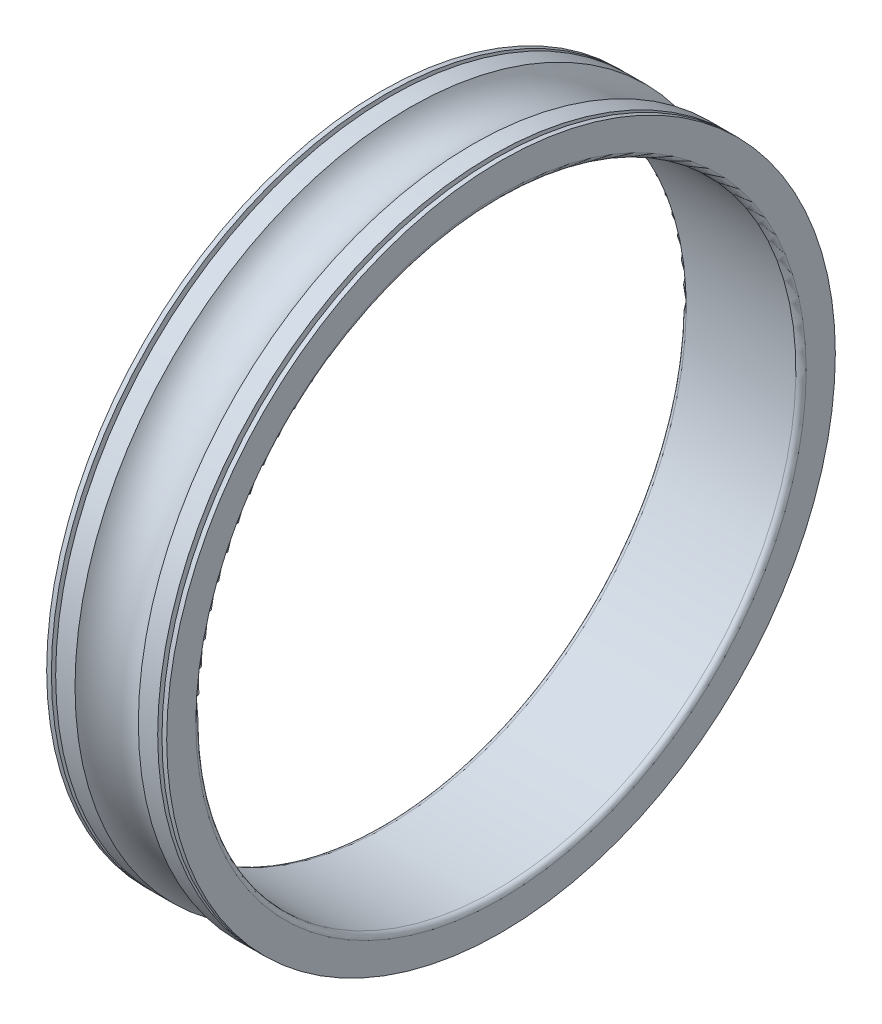
ISO-10303-21;
HEADER;
FILE_DESCRIPTION(('STEP AP214'),'2;1');
FILE_NAME('part.step','',(''),(''),'','','');
FILE_SCHEMA(('AUTOMOTIVE_DESIGN { 1 0 10303 214 1 1 1 1 }'));
ENDSEC;
DATA;
#1=APPLICATION_CONTEXT('core data for automotive mechanical design processes');
#2=APPLICATION_PROTOCOL_DEFINITION('international standard','automotive_design',2000,#1);
#3=PRODUCT_CONTEXT('',#1,'mechanical');
#4=PRODUCT('Part','Part','',(#3));
#5=PRODUCT_RELATED_PRODUCT_CATEGORY('part','',(#4));
#6=PRODUCT_DEFINITION_FORMATION('','',#4);
#7=PRODUCT_DEFINITION_CONTEXT('part definition',#1,'design');
#8=PRODUCT_DEFINITION('design','',#6,#7);
#9=PRODUCT_DEFINITION_SHAPE('','',#8);
#10=(LENGTH_UNIT() NAMED_UNIT(*) SI_UNIT(.MILLI.,.METRE.));
#11=(NAMED_UNIT(*) PLANE_ANGLE_UNIT() SI_UNIT($,.RADIAN.));
#12=(NAMED_UNIT(*) SI_UNIT($,.STERADIAN.) SOLID_ANGLE_UNIT());
#13=UNCERTAINTY_MEASURE_WITH_UNIT(LENGTH_MEASURE(1.E-05),#10,'distance_accuracy_value','');
#14=(GEOMETRIC_REPRESENTATION_CONTEXT(3) GLOBAL_UNCERTAINTY_ASSIGNED_CONTEXT((#13)) GLOBAL_UNIT_ASSIGNED_CONTEXT((#10,
#11,#12)) REPRESENTATION_CONTEXT('',''));
#15=CARTESIAN_POINT('',(0.,0.,0.));
#16=DIRECTION('',(0.,0.,1.));
#17=DIRECTION('',(1.,0.,0.));
#18=AXIS2_PLACEMENT_3D('',#15,#16,#17);
#19=CARTESIAN_POINT('',(0.,0.,0.));
#20=DIRECTION('',(-1.,0.,0.));
#21=DIRECTION('',(0.,1.,0.));
#22=AXIS2_PLACEMENT_3D('',#19,#20,#21);
#23=CYLINDRICAL_SURFACE('',#22,17.5);
#24=CARTESIAN_POINT('',(3.2,0.,0.));
#25=DIRECTION('',(1.,0.,0.));
#26=DIRECTION('',(0.,1.,0.));
#27=AXIS2_PLACEMENT_3D('',#24,#25,#26);
#28=CIRCLE('',#27,17.5);
#29=CARTESIAN_POINT('',(3.2,17.5,0.));
#30=VERTEX_POINT('',#29);
#31=EDGE_CURVE('E11',#30,#30,#28,.T.);
#32=ORIENTED_EDGE('',*,*,#31,.T.);
#33=EDGE_LOOP('',(#32));
#34=FACE_BOUND('',#33,.T.);
#35=CARTESIAN_POINT('',(-3.2,0.,0.));
#36=DIRECTION('',(1.,0.,0.));
#37=DIRECTION('',(0.,1.,0.));
#38=AXIS2_PLACEMENT_3D('',#35,#36,#37);
#39=CIRCLE('',#38,17.5);
#40=CARTESIAN_POINT('',(-3.2,17.5,0.));
#41=VERTEX_POINT('',#40);
#42=EDGE_CURVE('E90',#41,#41,#39,.T.);
#43=ORIENTED_EDGE('',*,*,#42,.F.);
#44=EDGE_LOOP('',(#43));
#45=FACE_BOUND('',#44,.T.);
#46=ADVANCED_FACE('F16',(#34,#45),#23,.F.);
#47=CARTESIAN_POINT('',(3.2,0.,0.));
#48=DIRECTION('',(1.,0.,0.));
#49=DIRECTION('',(0.,0.,-1.));
#50=AXIS2_PLACEMENT_3D('',#47,#48,#49);
#51=TOROIDAL_SURFACE('',#50,17.8,0.3);
#52=CARTESIAN_POINT('',(3.5,0.,0.));
#53=DIRECTION('',(1.,0.,0.));
#54=DIRECTION('',(0.,1.,0.));
#55=AXIS2_PLACEMENT_3D('',#52,#53,#54);
#56=CIRCLE('',#55,17.8);
#57=CARTESIAN_POINT('',(3.5,17.8,0.));
#58=VERTEX_POINT('',#57);
#59=EDGE_CURVE('E25',#58,#58,#56,.T.);
#60=ORIENTED_EDGE('',*,*,#59,.T.);
#61=EDGE_LOOP('',(#60));
#62=FACE_BOUND('',#61,.T.);
#63=ORIENTED_EDGE('',*,*,#31,.F.);
#64=EDGE_LOOP('',(#63));
#65=FACE_BOUND('',#64,.T.);
#66=ADVANCED_FACE('F140',(#62,#65),#51,.T.);
#67=CARTESIAN_POINT('',(3.5,18.65,0.));
#68=DIRECTION('',(1.,0.,0.));
#69=DIRECTION('',(0.,1.,0.));
#70=AXIS2_PLACEMENT_3D('',#67,#68,#69);
#71=PLANE('',#70);
#72=CARTESIAN_POINT('',(3.5,0.,0.));
#73=DIRECTION('',(1.,0.,0.));
#74=DIRECTION('',(0.,1.,0.));
#75=AXIS2_PLACEMENT_3D('',#72,#73,#74);
#76=CIRCLE('',#75,19.5);
#77=CARTESIAN_POINT('',(3.5,19.5,0.));
#78=VERTEX_POINT('',#77);
#79=EDGE_CURVE('E89',#78,#78,#76,.T.);
#80=ORIENTED_EDGE('',*,*,#79,.T.);
#81=EDGE_LOOP('',(#80));
#82=FACE_BOUND('',#81,.T.);
#83=ORIENTED_EDGE('',*,*,#59,.F.);
#84=EDGE_LOOP('',(#83));
#85=FACE_BOUND('',#84,.T.);
#86=ADVANCED_FACE('F145',(#82,#85),#71,.T.);
#87=CARTESIAN_POINT('',(2.67330926563097,0.,0.));
#88=DIRECTION('',(-1.,0.,0.));
#89=DIRECTION('',(0.,1.,0.));
#90=AXIS2_PLACEMENT_3D('',#87,#88,#89);
#91=CYLINDRICAL_SURFACE('',#90,19.5);
#92=ORIENTED_EDGE('',*,*,#79,.F.);
#93=EDGE_LOOP('',(#92));
#94=FACE_BOUND('',#93,.T.);
#95=CARTESIAN_POINT('',(3.225,0.,0.));
#96=DIRECTION('',(1.,0.,0.));
#97=DIRECTION('',(0.,1.,0.));
#98=AXIS2_PLACEMENT_3D('',#95,#96,#97);
#99=CIRCLE('',#98,19.5);
#100=CARTESIAN_POINT('',(3.225,-19.5,0.));
#101=VERTEX_POINT('',#100);
#102=EDGE_CURVE('E75',#101,#101,#99,.T.);
#103=ORIENTED_EDGE('',*,*,#102,.T.);
#104=EDGE_LOOP('',(#103));
#105=FACE_BOUND('',#104,.T.);
#106=ADVANCED_FACE('F76',(#94,#105),#91,.T.);
#107=CARTESIAN_POINT('',(0.,0.,0.));
#108=DIRECTION('',(1.,0.,0.));
#109=DIRECTION('',(0.,0.,-1.));
#110=AXIS2_PLACEMENT_3D('',#107,#108,#109);
#111=TOROIDAL_SURFACE('',#110,20.5,2.1);
#112=CARTESIAN_POINT('',(-1.84661853126194,0.,0.));
#113=DIRECTION('',(1.,0.,0.));
#114=DIRECTION('',(0.,1.,0.));
#115=AXIS2_PLACEMENT_3D('',#112,#113,#114);
#116=CIRCLE('',#115,19.5);
#117=CARTESIAN_POINT('',(-1.84661853126194,19.5,0.));
#118=VERTEX_POINT('',#117);
#119=EDGE_CURVE('E96',#118,#118,#116,.T.);
#120=ORIENTED_EDGE('',*,*,#119,.T.);
#121=EDGE_LOOP('',(#120));
#122=FACE_BOUND('',#121,.T.);
#123=CARTESIAN_POINT('',(1.84661853126194,0.,0.));
#124=DIRECTION('',(1.,0.,0.));
#125=DIRECTION('',(0.,1.,0.));
#126=AXIS2_PLACEMENT_3D('',#123,#124,#125);
#127=CIRCLE('',#126,19.5);
#128=CARTESIAN_POINT('',(1.84661853126194,19.5,0.));
#129=VERTEX_POINT('',#128);
#130=EDGE_CURVE('E80',#129,#129,#127,.T.);
#131=ORIENTED_EDGE('',*,*,#130,.F.);
#132=EDGE_LOOP('',(#131));
#133=FACE_BOUND('',#132,.T.);
#134=ADVANCED_FACE('F126',(#122,#133),#111,.F.);
#135=CARTESIAN_POINT('',(-2.67330926563097,0.,0.));
#136=DIRECTION('',(-1.,0.,0.));
#137=DIRECTION('',(0.,1.,0.));
#138=AXIS2_PLACEMENT_3D('',#135,#136,#137);
#139=CYLINDRICAL_SURFACE('',#138,19.5);
#140=CARTESIAN_POINT('',(-3.5,0.,0.));
#141=DIRECTION('',(1.,0.,0.));
#142=DIRECTION('',(0.,1.,0.));
#143=AXIS2_PLACEMENT_3D('',#140,#141,#142);
#144=CIRCLE('',#143,19.5);
#145=CARTESIAN_POINT('',(-3.5,19.5,0.));
#146=VERTEX_POINT('',#145);
#147=EDGE_CURVE('E87',#146,#146,#144,.T.);
#148=ORIENTED_EDGE('',*,*,#147,.T.);
#149=EDGE_LOOP('',(#148));
#150=FACE_BOUND('',#149,.T.);
#151=CARTESIAN_POINT('',(-3.225,0.,0.));
#152=DIRECTION('',(-1.,0.,0.));
#153=DIRECTION('',(0.,1.,0.));
#154=AXIS2_PLACEMENT_3D('',#151,#152,#153);
#155=CIRCLE('',#154,19.5);
#156=CARTESIAN_POINT('',(-3.225,-19.5,0.));
#157=VERTEX_POINT('',#156);
#158=EDGE_CURVE('E93',#157,#157,#155,.T.);
#159=ORIENTED_EDGE('',*,*,#158,.T.);
#160=EDGE_LOOP('',(#159));
#161=FACE_BOUND('',#160,.T.);
#162=ADVANCED_FACE('F123',(#150,#161),#139,.T.);
#163=CARTESIAN_POINT('',(-3.5,18.65,0.));
#164=DIRECTION('',(-1.,0.,0.));
#165=DIRECTION('',(0.,-1.,0.));
#166=AXIS2_PLACEMENT_3D('',#163,#164,#165);
#167=PLANE('',#166);
#168=CARTESIAN_POINT('',(-3.5,0.,0.));
#169=DIRECTION('',(1.,0.,0.));
#170=DIRECTION('',(0.,1.,0.));
#171=AXIS2_PLACEMENT_3D('',#168,#169,#170);
#172=CIRCLE('',#171,17.8);
#173=CARTESIAN_POINT('',(-3.5,17.8,0.));
#174=VERTEX_POINT('',#173);
#175=EDGE_CURVE('E98',#174,#174,#172,.T.);
#176=ORIENTED_EDGE('',*,*,#175,.T.);
#177=EDGE_LOOP('',(#176));
#178=FACE_BOUND('',#177,.T.);
#179=ORIENTED_EDGE('',*,*,#147,.F.);
#180=EDGE_LOOP('',(#179));
#181=FACE_BOUND('',#180,.T.);
#182=ADVANCED_FACE('F125',(#178,#181),#167,.T.);
#183=CARTESIAN_POINT('',(-3.2,0.,0.));
#184=DIRECTION('',(1.,0.,0.));
#185=DIRECTION('',(0.,0.,-1.));
#186=AXIS2_PLACEMENT_3D('',#183,#184,#185);
#187=TOROIDAL_SURFACE('',#186,17.8,0.3);
#188=ORIENTED_EDGE('',*,*,#42,.T.);
#189=EDGE_LOOP('',(#188));
#190=FACE_BOUND('',#189,.T.);
#191=ORIENTED_EDGE('',*,*,#175,.F.);
#192=EDGE_LOOP('',(#191));
#193=FACE_BOUND('',#192,.T.);
#194=ADVANCED_FACE('F18',(#190,#193),#187,.T.);
#195=CARTESIAN_POINT('',(-2.67330926563097,0.,0.));
#196=DIRECTION('',(-1.,0.,0.));
#197=DIRECTION('',(0.,1.,0.));
#198=AXIS2_PLACEMENT_3D('',#195,#196,#197);
#199=CYLINDRICAL_SURFACE('',#198,19.5);
#200=ORIENTED_EDGE('',*,*,#119,.F.);
#201=EDGE_LOOP('',(#200));
#202=FACE_BOUND('',#201,.T.);
#203=CARTESIAN_POINT('',(-2.975,0.,0.));
#204=DIRECTION('',(1.,0.,0.));
#205=DIRECTION('',(0.,1.,0.));
#206=AXIS2_PLACEMENT_3D('',#203,#204,#205);
#207=CIRCLE('',#206,19.5);
#208=CARTESIAN_POINT('',(-2.975,-19.5,0.));
#209=VERTEX_POINT('',#208);
#210=EDGE_CURVE('E95',#209,#209,#207,.T.);
#211=ORIENTED_EDGE('',*,*,#210,.T.);
#212=EDGE_LOOP('',(#211));
#213=FACE_BOUND('',#212,.T.);
#214=ADVANCED_FACE('F216',(#202,#213),#199,.T.);
#215=CARTESIAN_POINT('',(-2.975,20.5,0.));
#216=DIRECTION('',(1.,0.,0.));
#217=DIRECTION('',(0.,1.,0.));
#218=AXIS2_PLACEMENT_3D('',#215,#216,#217);
#219=PLANE('',#218);
#220=CARTESIAN_POINT('',(-2.975,0.,0.));
#221=DIRECTION('',(1.,0.,0.));
#222=DIRECTION('',(0.,1.,0.));
#223=AXIS2_PLACEMENT_3D('',#220,#221,#222);
#224=CIRCLE('',#223,18.5);
#225=CARTESIAN_POINT('',(-2.975,18.5,0.));
#226=VERTEX_POINT('',#225);
#227=EDGE_CURVE('E86',#226,#226,#224,.T.);
#228=ORIENTED_EDGE('',*,*,#227,.T.);
#229=EDGE_LOOP('',(#228));
#230=FACE_BOUND('',#229,.T.);
#231=ORIENTED_EDGE('',*,*,#210,.F.);
#232=EDGE_LOOP('',(#231));
#233=FACE_BOUND('',#232,.T.);
#234=ADVANCED_FACE('F107',(#230,#233),#219,.F.);
#235=CARTESIAN_POINT('',(-3.225,20.5,0.));
#236=DIRECTION('',(-1.,0.,0.));
#237=DIRECTION('',(0.,-1.,0.));
#238=AXIS2_PLACEMENT_3D('',#235,#236,#237);
#239=PLANE('',#238);
#240=CARTESIAN_POINT('',(-3.225,0.,0.));
#241=DIRECTION('',(1.,0.,0.));
#242=DIRECTION('',(0.,1.,0.));
#243=AXIS2_PLACEMENT_3D('',#240,#241,#242);
#244=CIRCLE('',#243,18.5);
#245=CARTESIAN_POINT('',(-3.225,18.5,0.));
#246=VERTEX_POINT('',#245);
#247=EDGE_CURVE('E84',#246,#246,#244,.T.);
#248=ORIENTED_EDGE('',*,*,#247,.F.);
#249=EDGE_LOOP('',(#248));
#250=FACE_BOUND('',#249,.T.);
#251=ORIENTED_EDGE('',*,*,#158,.F.);
#252=EDGE_LOOP('',(#251));
#253=FACE_BOUND('',#252,.T.);
#254=ADVANCED_FACE('F114',(#250,#253),#239,.F.);
#255=CARTESIAN_POINT('',(-3.1,0.,0.));
#256=DIRECTION('',(-1.,0.,0.));
#257=DIRECTION('',(0.,1.,0.));
#258=AXIS2_PLACEMENT_3D('',#255,#256,#257);
#259=CYLINDRICAL_SURFACE('',#258,18.5);
#260=ORIENTED_EDGE('',*,*,#227,.F.);
#261=EDGE_LOOP('',(#260));
#262=FACE_BOUND('',#261,.T.);
#263=ORIENTED_EDGE('',*,*,#247,.T.);
#264=EDGE_LOOP('',(#263));
#265=FACE_BOUND('',#264,.T.);
#266=ADVANCED_FACE('F110',(#262,#265),#259,.T.);
#267=CARTESIAN_POINT('',(2.67330926563097,0.,0.));
#268=DIRECTION('',(-1.,0.,0.));
#269=DIRECTION('',(0.,1.,0.));
#270=AXIS2_PLACEMENT_3D('',#267,#268,#269);
#271=CYLINDRICAL_SURFACE('',#270,19.5);
#272=ORIENTED_EDGE('',*,*,#130,.T.);
#273=EDGE_LOOP('',(#272));
#274=FACE_BOUND('',#273,.T.);
#275=CARTESIAN_POINT('',(2.975,0.,0.));
#276=DIRECTION('',(-1.,0.,0.));
#277=DIRECTION('',(0.,1.,0.));
#278=AXIS2_PLACEMENT_3D('',#275,#276,#277);
#279=CIRCLE('',#278,19.5);
#280=CARTESIAN_POINT('',(2.975,-19.5,0.));
#281=VERTEX_POINT('',#280);
#282=EDGE_CURVE('E78',#281,#281,#279,.T.);
#283=ORIENTED_EDGE('',*,*,#282,.T.);
#284=EDGE_LOOP('',(#283));
#285=FACE_BOUND('',#284,.T.);
#286=ADVANCED_FACE('F113',(#274,#285),#271,.T.);
#287=CARTESIAN_POINT('',(2.975,20.5,0.));
#288=DIRECTION('',(-1.,0.,0.));
#289=DIRECTION('',(0.,1.,0.));
#290=AXIS2_PLACEMENT_3D('',#287,#288,#289);
#291=PLANE('',#290);
#292=CARTESIAN_POINT('',(2.975,0.,0.));
#293=DIRECTION('',(-1.,0.,0.));
#294=DIRECTION('',(0.,1.,0.));
#295=AXIS2_PLACEMENT_3D('',#292,#293,#294);
#296=CIRCLE('',#295,18.5);
#297=CARTESIAN_POINT('',(2.975,18.5,0.));
#298=VERTEX_POINT('',#297);
#299=EDGE_CURVE('E20',#298,#298,#296,.T.);
#300=ORIENTED_EDGE('',*,*,#299,.T.);
#301=EDGE_LOOP('',(#300));
#302=FACE_BOUND('',#301,.T.);
#303=ORIENTED_EDGE('',*,*,#282,.F.);
#304=EDGE_LOOP('',(#303));
#305=FACE_BOUND('',#304,.T.);
#306=ADVANCED_FACE('F149',(#302,#305),#291,.F.);
#307=CARTESIAN_POINT('',(3.225,20.5,0.));
#308=DIRECTION('',(1.,0.,0.));
#309=DIRECTION('',(0.,-1.,0.));
#310=AXIS2_PLACEMENT_3D('',#307,#308,#309);
#311=PLANE('',#310);
#312=CARTESIAN_POINT('',(3.225,0.,0.));
#313=DIRECTION('',(-1.,0.,0.));
#314=DIRECTION('',(0.,1.,0.));
#315=AXIS2_PLACEMENT_3D('',#312,#313,#314);
#316=CIRCLE('',#315,18.5);
#317=CARTESIAN_POINT('',(3.225,18.5,0.));
#318=VERTEX_POINT('',#317);
#319=EDGE_CURVE('E81',#318,#318,#316,.T.);
#320=ORIENTED_EDGE('',*,*,#319,.F.);
#321=EDGE_LOOP('',(#320));
#322=FACE_BOUND('',#321,.T.);
#323=ORIENTED_EDGE('',*,*,#102,.F.);
#324=EDGE_LOOP('',(#323));
#325=FACE_BOUND('',#324,.T.);
#326=ADVANCED_FACE('F152',(#322,#325),#311,.F.);
#327=CARTESIAN_POINT('',(3.1,0.,0.));
#328=DIRECTION('',(1.,0.,0.));
#329=DIRECTION('',(0.,1.,0.));
#330=AXIS2_PLACEMENT_3D('',#327,#328,#329);
#331=CYLINDRICAL_SURFACE('',#330,18.5);
#332=ORIENTED_EDGE('',*,*,#299,.F.);
#333=EDGE_LOOP('',(#332));
#334=FACE_BOUND('',#333,.T.);
#335=ORIENTED_EDGE('',*,*,#319,.T.);
#336=EDGE_LOOP('',(#335));
#337=FACE_BOUND('',#336,.T.);
#338=ADVANCED_FACE('F177',(#334,#337),#331,.T.);
#339=CLOSED_SHELL('',(#46,#66,#86,#106,#134,#162,#182,#194,#214,#234,#254,#266,#286,#306,#326,#338));
#340=MANIFOLD_SOLID_BREP('B1',#339);
#341=ADVANCED_BREP_SHAPE_REPRESENTATION('',(#18,#340),#14);
#342=SHAPE_DEFINITION_REPRESENTATION(#9,#341);
ENDSEC;
END-ISO-10303-21;
